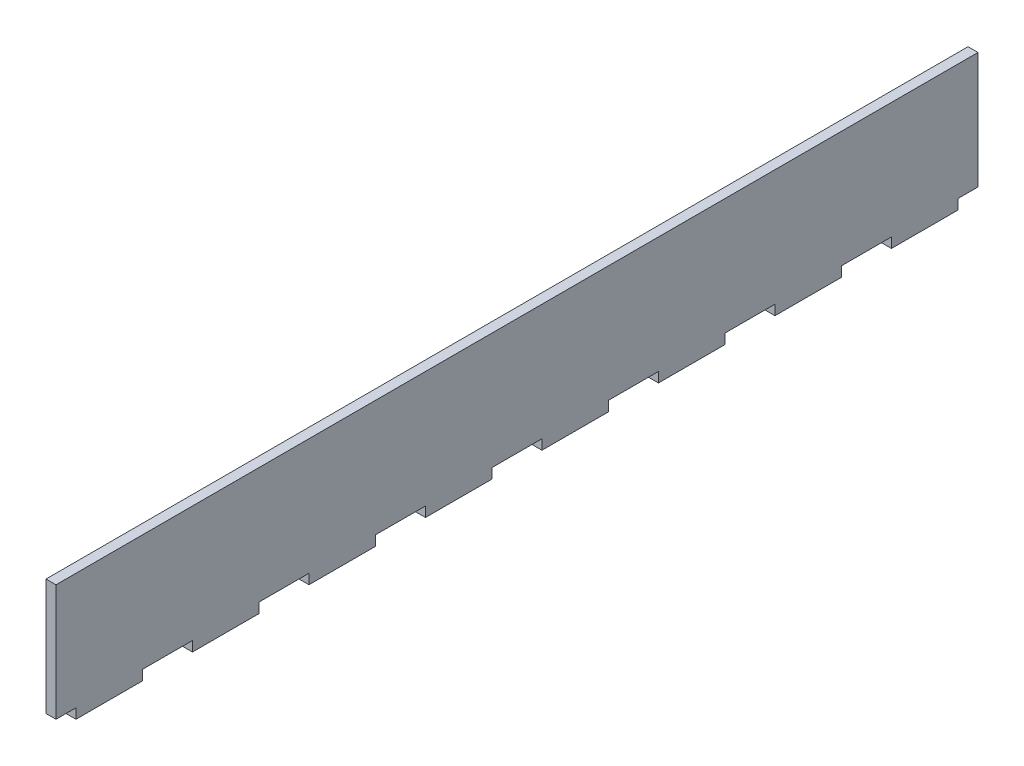
ISO-10303-21;
HEADER;
FILE_DESCRIPTION(('STEP AP214'),'2;1');
FILE_NAME('part.step','',(''),(''),'','','');
FILE_SCHEMA(('AUTOMOTIVE_DESIGN { 1 0 10303 214 1 1 1 1 }'));
ENDSEC;
DATA;
#1=APPLICATION_CONTEXT('core data for automotive mechanical design processes');
#2=APPLICATION_PROTOCOL_DEFINITION('international standard','automotive_design',2000,#1);
#3=PRODUCT_CONTEXT('',#1,'mechanical');
#4=PRODUCT('Part','Part','',(#3));
#5=PRODUCT_RELATED_PRODUCT_CATEGORY('part','',(#4));
#6=PRODUCT_DEFINITION_FORMATION('','',#4);
#7=PRODUCT_DEFINITION_CONTEXT('part definition',#1,'design');
#8=PRODUCT_DEFINITION('design','',#6,#7);
#9=PRODUCT_DEFINITION_SHAPE('','',#8);
#10=(LENGTH_UNIT() NAMED_UNIT(*) SI_UNIT(.MILLI.,.METRE.));
#11=(NAMED_UNIT(*) PLANE_ANGLE_UNIT() SI_UNIT($,.RADIAN.));
#12=(NAMED_UNIT(*) SI_UNIT($,.STERADIAN.) SOLID_ANGLE_UNIT());
#13=UNCERTAINTY_MEASURE_WITH_UNIT(LENGTH_MEASURE(1.E-05),#10,'distance_accuracy_value','');
#14=(GEOMETRIC_REPRESENTATION_CONTEXT(3) GLOBAL_UNCERTAINTY_ASSIGNED_CONTEXT((#13)) GLOBAL_UNIT_ASSIGNED_CONTEXT((#10,
#11,#12)) REPRESENTATION_CONTEXT('',''));
#15=CARTESIAN_POINT('',(0.,0.,0.));
#16=DIRECTION('',(0.,0.,1.));
#17=DIRECTION('',(1.,0.,0.));
#18=AXIS2_PLACEMENT_3D('',#15,#16,#17);
#19=CARTESIAN_POINT('',(3.,0.,0.));
#20=DIRECTION('',(0.,0.,1.));
#21=DIRECTION('',(1.,0.,0.));
#22=AXIS2_PLACEMENT_3D('',#19,#20,#21);
#23=PLANE('',#22);
#24=DIRECTION('',(0.,1.,0.));
#25=VECTOR('',#24,1.);
#26=CARTESIAN_POINT('',(0.,0.,0.));
#27=LINE('',#26,#25);
#28=CARTESIAN_POINT('',(0.,0.,0.));
#29=VERTEX_POINT('',#28);
#30=CARTESIAN_POINT('',(0.,35.,0.));
#31=VERTEX_POINT('',#30);
#32=EDGE_CURVE('E300',#29,#31,#27,.T.);
#33=ORIENTED_EDGE('',*,*,#32,.F.);
#34=DIRECTION('',(-1.,0.,0.));
#35=VECTOR('',#34,1.);
#36=CARTESIAN_POINT('',(3.,0.,0.));
#37=LINE('',#36,#35);
#38=CARTESIAN_POINT('',(3.,0.,0.));
#39=VERTEX_POINT('',#38);
#40=EDGE_CURVE('E11',#39,#29,#37,.T.);
#41=ORIENTED_EDGE('',*,*,#40,.F.);
#42=DIRECTION('',(0.,1.,0.));
#43=VECTOR('',#42,1.);
#44=CARTESIAN_POINT('',(3.,0.,0.));
#45=LINE('',#44,#43);
#46=CARTESIAN_POINT('',(3.,35.,0.));
#47=VERTEX_POINT('',#46);
#48=EDGE_CURVE('E387',#39,#47,#45,.T.);
#49=ORIENTED_EDGE('',*,*,#48,.T.);
#50=DIRECTION('',(-1.,0.,0.));
#51=VECTOR('',#50,1.);
#52=CARTESIAN_POINT('',(3.,35.,0.));
#53=LINE('',#52,#51);
#54=EDGE_CURVE('E36',#47,#31,#53,.T.);
#55=ORIENTED_EDGE('',*,*,#54,.T.);
#56=EDGE_LOOP('',(#33,#41,#49,#55));
#57=FACE_BOUND('',#56,.T.);
#58=ADVANCED_FACE('F33',(#57),#23,.T.);
#59=CARTESIAN_POINT('',(3.,0.,0.));
#60=DIRECTION('',(0.,1.,0.));
#61=DIRECTION('',(0.,0.,1.));
#62=AXIS2_PLACEMENT_3D('',#59,#60,#61);
#63=PLANE('',#62);
#64=DIRECTION('',(0.,0.,-1.));
#65=VECTOR('',#64,1.);
#66=CARTESIAN_POINT('',(0.,0.,0.));
#67=LINE('',#66,#65);
#68=CARTESIAN_POINT('',(0.,0.,-6.00000000000001));
#69=VERTEX_POINT('',#68);
#70=EDGE_CURVE('E162',#29,#69,#67,.T.);
#71=ORIENTED_EDGE('',*,*,#70,.T.);
#72=DIRECTION('',(-1.,0.,0.));
#73=VECTOR('',#72,1.);
#74=CARTESIAN_POINT('',(3.,0.,-6.00000000000001));
#75=LINE('',#74,#73);
#76=CARTESIAN_POINT('',(3.,0.,-6.00000000000001));
#77=VERTEX_POINT('',#76);
#78=EDGE_CURVE('E42',#77,#69,#75,.T.);
#79=ORIENTED_EDGE('',*,*,#78,.F.);
#80=DIRECTION('',(0.,0.,-1.));
#81=VECTOR('',#80,1.);
#82=CARTESIAN_POINT('',(3.,0.,0.));
#83=LINE('',#82,#81);
#84=EDGE_CURVE('E278',#39,#77,#83,.T.);
#85=ORIENTED_EDGE('',*,*,#84,.F.);
#86=ORIENTED_EDGE('',*,*,#40,.T.);
#87=EDGE_LOOP('',(#71,#79,#85,#86));
#88=FACE_BOUND('',#87,.T.);
#89=ADVANCED_FACE('F691',(#88),#63,.F.);
#90=CARTESIAN_POINT('',(3.,0.,-6.00000000000001));
#91=DIRECTION('',(0.,0.,-1.));
#92=DIRECTION('',(0.,1.,0.));
#93=AXIS2_PLACEMENT_3D('',#90,#91,#92);
#94=PLANE('',#93);
#95=DIRECTION('',(0.,-1.,0.));
#96=VECTOR('',#95,1.);
#97=CARTESIAN_POINT('',(0.,0.,-6.00000000000001));
#98=LINE('',#97,#96);
#99=CARTESIAN_POINT('',(0.,-3.,-6.));
#100=VERTEX_POINT('',#99);
#101=EDGE_CURVE('E285',#69,#100,#98,.T.);
#102=ORIENTED_EDGE('',*,*,#101,.T.);
#103=DIRECTION('',(-1.,0.,0.));
#104=VECTOR('',#103,1.);
#105=CARTESIAN_POINT('',(3.,-3.,-6.));
#106=LINE('',#105,#104);
#107=CARTESIAN_POINT('',(3.,-3.,-6.));
#108=VERTEX_POINT('',#107);
#109=EDGE_CURVE('E282',#108,#100,#106,.T.);
#110=ORIENTED_EDGE('',*,*,#109,.F.);
#111=DIRECTION('',(0.,-1.,0.));
#112=VECTOR('',#111,1.);
#113=CARTESIAN_POINT('',(3.,0.,-6.00000000000001));
#114=LINE('',#113,#112);
#115=EDGE_CURVE('E270',#77,#108,#114,.T.);
#116=ORIENTED_EDGE('',*,*,#115,.F.);
#117=ORIENTED_EDGE('',*,*,#78,.T.);
#118=EDGE_LOOP('',(#102,#110,#116,#117));
#119=FACE_BOUND('',#118,.T.);
#120=ADVANCED_FACE('F283',(#119),#94,.F.);
#121=CARTESIAN_POINT('',(3.,-3.,-6.));
#122=DIRECTION('',(0.,1.,0.));
#123=DIRECTION('',(0.,0.,1.));
#124=AXIS2_PLACEMENT_3D('',#121,#122,#123);
#125=PLANE('',#124);
#126=DIRECTION('',(0.,0.,-1.));
#127=VECTOR('',#126,1.);
#128=CARTESIAN_POINT('',(0.,-3.,-6.));
#129=LINE('',#128,#127);
#130=CARTESIAN_POINT('',(0.,-3.,-26.));
#131=VERTEX_POINT('',#130);
#132=EDGE_CURVE('E384',#100,#131,#129,.T.);
#133=ORIENTED_EDGE('',*,*,#132,.T.);
#134=DIRECTION('',(-1.,0.,0.));
#135=VECTOR('',#134,1.);
#136=CARTESIAN_POINT('',(3.,-3.,-26.));
#137=LINE('',#136,#135);
#138=CARTESIAN_POINT('',(3.,-3.,-26.));
#139=VERTEX_POINT('',#138);
#140=EDGE_CURVE('E289',#139,#131,#137,.T.);
#141=ORIENTED_EDGE('',*,*,#140,.F.);
#142=DIRECTION('',(0.,0.,-1.));
#143=VECTOR('',#142,1.);
#144=CARTESIAN_POINT('',(3.,-3.,-6.));
#145=LINE('',#144,#143);
#146=EDGE_CURVE('E276',#108,#139,#145,.T.);
#147=ORIENTED_EDGE('',*,*,#146,.F.);
#148=ORIENTED_EDGE('',*,*,#109,.T.);
#149=EDGE_LOOP('',(#133,#141,#147,#148));
#150=FACE_BOUND('',#149,.T.);
#151=ADVANCED_FACE('F291',(#150),#125,.F.);
#152=CARTESIAN_POINT('',(3.,0.,-26.));
#153=DIRECTION('',(0.,0.,-1.));
#154=DIRECTION('',(0.,1.,0.));
#155=AXIS2_PLACEMENT_3D('',#152,#153,#154);
#156=PLANE('',#155);
#157=DIRECTION('',(0.,-1.,0.));
#158=VECTOR('',#157,1.);
#159=CARTESIAN_POINT('',(0.,0.,-26.));
#160=LINE('',#159,#158);
#161=CARTESIAN_POINT('',(0.,0.,-26.));
#162=VERTEX_POINT('',#161);
#163=EDGE_CURVE('E381',#162,#131,#160,.T.);
#164=ORIENTED_EDGE('',*,*,#163,.F.);
#165=DIRECTION('',(-1.,0.,0.));
#166=VECTOR('',#165,1.);
#167=CARTESIAN_POINT('',(3.,0.,-26.));
#168=LINE('',#167,#166);
#169=CARTESIAN_POINT('',(3.,0.,-26.));
#170=VERTEX_POINT('',#169);
#171=EDGE_CURVE('E391',#170,#162,#168,.T.);
#172=ORIENTED_EDGE('',*,*,#171,.F.);
#173=DIRECTION('',(0.,-1.,0.));
#174=VECTOR('',#173,1.);
#175=CARTESIAN_POINT('',(3.,0.,-26.));
#176=LINE('',#175,#174);
#177=EDGE_CURVE('E293',#170,#139,#176,.T.);
#178=ORIENTED_EDGE('',*,*,#177,.T.);
#179=ORIENTED_EDGE('',*,*,#140,.T.);
#180=EDGE_LOOP('',(#164,#172,#178,#179));
#181=FACE_BOUND('',#180,.T.);
#182=ADVANCED_FACE('F475',(#181),#156,.T.);
#183=CARTESIAN_POINT('',(3.,0.,-26.));
#184=DIRECTION('',(0.,1.,0.));
#185=DIRECTION('',(0.,0.,1.));
#186=AXIS2_PLACEMENT_3D('',#183,#184,#185);
#187=PLANE('',#186);
#188=DIRECTION('',(0.,0.,-1.));
#189=VECTOR('',#188,1.);
#190=CARTESIAN_POINT('',(0.,0.,-26.));
#191=LINE('',#190,#189);
#192=CARTESIAN_POINT('',(0.,0.,-41.));
#193=VERTEX_POINT('',#192);
#194=EDGE_CURVE('E379',#162,#193,#191,.T.);
#195=ORIENTED_EDGE('',*,*,#194,.T.);
#196=DIRECTION('',(-1.,0.,0.));
#197=VECTOR('',#196,1.);
#198=CARTESIAN_POINT('',(3.,0.,-41.));
#199=LINE('',#198,#197);
#200=CARTESIAN_POINT('',(3.,0.,-41.));
#201=VERTEX_POINT('',#200);
#202=EDGE_CURVE('E393',#201,#193,#199,.T.);
#203=ORIENTED_EDGE('',*,*,#202,.F.);
#204=DIRECTION('',(0.,0.,-1.));
#205=VECTOR('',#204,1.);
#206=CARTESIAN_POINT('',(3.,0.,-26.));
#207=LINE('',#206,#205);
#208=EDGE_CURVE('E295',#170,#201,#207,.T.);
#209=ORIENTED_EDGE('',*,*,#208,.F.);
#210=ORIENTED_EDGE('',*,*,#171,.T.);
#211=EDGE_LOOP('',(#195,#203,#209,#210));
#212=FACE_BOUND('',#211,.T.);
#213=ADVANCED_FACE('F482',(#212),#187,.F.);
#214=CARTESIAN_POINT('',(3.,0.,-41.));
#215=DIRECTION('',(0.,0.,-1.));
#216=DIRECTION('',(0.,1.,0.));
#217=AXIS2_PLACEMENT_3D('',#214,#215,#216);
#218=PLANE('',#217);
#219=DIRECTION('',(0.,-1.,0.));
#220=VECTOR('',#219,1.);
#221=CARTESIAN_POINT('',(0.,0.,-41.));
#222=LINE('',#221,#220);
#223=CARTESIAN_POINT('',(0.,-3.,-41.));
#224=VERTEX_POINT('',#223);
#225=EDGE_CURVE('E377',#193,#224,#222,.T.);
#226=ORIENTED_EDGE('',*,*,#225,.T.);
#227=DIRECTION('',(-1.,0.,0.));
#228=VECTOR('',#227,1.);
#229=CARTESIAN_POINT('',(3.,-3.,-41.));
#230=LINE('',#229,#228);
#231=CARTESIAN_POINT('',(3.,-3.,-41.));
#232=VERTEX_POINT('',#231);
#233=EDGE_CURVE('E396',#232,#224,#230,.T.);
#234=ORIENTED_EDGE('',*,*,#233,.F.);
#235=DIRECTION('',(0.,-1.,0.));
#236=VECTOR('',#235,1.);
#237=CARTESIAN_POINT('',(3.,0.,-41.));
#238=LINE('',#237,#236);
#239=EDGE_CURVE('E479',#201,#232,#238,.T.);
#240=ORIENTED_EDGE('',*,*,#239,.F.);
#241=ORIENTED_EDGE('',*,*,#202,.T.);
#242=EDGE_LOOP('',(#226,#234,#240,#241));
#243=FACE_BOUND('',#242,.T.);
#244=ADVANCED_FACE('F484',(#243),#218,.F.);
#245=CARTESIAN_POINT('',(3.,-3.,-41.));
#246=DIRECTION('',(0.,1.,0.));
#247=DIRECTION('',(0.,0.,1.));
#248=AXIS2_PLACEMENT_3D('',#245,#246,#247);
#249=PLANE('',#248);
#250=DIRECTION('',(0.,0.,-1.));
#251=VECTOR('',#250,1.);
#252=CARTESIAN_POINT('',(0.,-3.,-41.));
#253=LINE('',#252,#251);
#254=CARTESIAN_POINT('',(0.,-3.,-61.));
#255=VERTEX_POINT('',#254);
#256=EDGE_CURVE('E374',#224,#255,#253,.T.);
#257=ORIENTED_EDGE('',*,*,#256,.T.);
#258=DIRECTION('',(-1.,0.,0.));
#259=VECTOR('',#258,1.);
#260=CARTESIAN_POINT('',(3.,-3.,-61.));
#261=LINE('',#260,#259);
#262=CARTESIAN_POINT('',(3.,-3.,-61.));
#263=VERTEX_POINT('',#262);
#264=EDGE_CURVE('E399',#263,#255,#261,.T.);
#265=ORIENTED_EDGE('',*,*,#264,.F.);
#266=DIRECTION('',(0.,0.,-1.));
#267=VECTOR('',#266,1.);
#268=CARTESIAN_POINT('',(3.,-3.,-41.));
#269=LINE('',#268,#267);
#270=EDGE_CURVE('E486',#232,#263,#269,.T.);
#271=ORIENTED_EDGE('',*,*,#270,.F.);
#272=ORIENTED_EDGE('',*,*,#233,.T.);
#273=EDGE_LOOP('',(#257,#265,#271,#272));
#274=FACE_BOUND('',#273,.T.);
#275=ADVANCED_FACE('F681',(#274),#249,.F.);
#276=CARTESIAN_POINT('',(3.,0.,-61.));
#277=DIRECTION('',(0.,0.,-1.));
#278=DIRECTION('',(0.,1.,0.));
#279=AXIS2_PLACEMENT_3D('',#276,#277,#278);
#280=PLANE('',#279);
#281=DIRECTION('',(0.,-1.,0.));
#282=VECTOR('',#281,1.);
#283=CARTESIAN_POINT('',(0.,0.,-61.));
#284=LINE('',#283,#282);
#285=CARTESIAN_POINT('',(0.,0.,-61.));
#286=VERTEX_POINT('',#285);
#287=EDGE_CURVE('E371',#286,#255,#284,.T.);
#288=ORIENTED_EDGE('',*,*,#287,.F.);
#289=DIRECTION('',(-1.,0.,0.));
#290=VECTOR('',#289,1.);
#291=CARTESIAN_POINT('',(3.,0.,-61.));
#292=LINE('',#291,#290);
#293=CARTESIAN_POINT('',(3.,0.,-61.));
#294=VERTEX_POINT('',#293);
#295=EDGE_CURVE('E401',#294,#286,#292,.T.);
#296=ORIENTED_EDGE('',*,*,#295,.F.);
#297=DIRECTION('',(0.,-1.,0.));
#298=VECTOR('',#297,1.);
#299=CARTESIAN_POINT('',(3.,0.,-61.));
#300=LINE('',#299,#298);
#301=EDGE_CURVE('E488',#294,#263,#300,.T.);
#302=ORIENTED_EDGE('',*,*,#301,.T.);
#303=ORIENTED_EDGE('',*,*,#264,.T.);
#304=EDGE_LOOP('',(#288,#296,#302,#303));
#305=FACE_BOUND('',#304,.T.);
#306=ADVANCED_FACE('F678',(#305),#280,.T.);
#307=CARTESIAN_POINT('',(3.,0.,-61.));
#308=DIRECTION('',(0.,1.,0.));
#309=DIRECTION('',(0.,0.,1.));
#310=AXIS2_PLACEMENT_3D('',#307,#308,#309);
#311=PLANE('',#310);
#312=DIRECTION('',(0.,0.,-1.));
#313=VECTOR('',#312,1.);
#314=CARTESIAN_POINT('',(0.,0.,-61.));
#315=LINE('',#314,#313);
#316=CARTESIAN_POINT('',(0.,0.,-76.));
#317=VERTEX_POINT('',#316);
#318=EDGE_CURVE('E369',#286,#317,#315,.T.);
#319=ORIENTED_EDGE('',*,*,#318,.T.);
#320=DIRECTION('',(-1.,0.,0.));
#321=VECTOR('',#320,1.);
#322=CARTESIAN_POINT('',(3.,0.,-76.));
#323=LINE('',#322,#321);
#324=CARTESIAN_POINT('',(3.,0.,-76.));
#325=VERTEX_POINT('',#324);
#326=EDGE_CURVE('E403',#325,#317,#323,.T.);
#327=ORIENTED_EDGE('',*,*,#326,.F.);
#328=DIRECTION('',(0.,0.,-1.));
#329=VECTOR('',#328,1.);
#330=CARTESIAN_POINT('',(3.,0.,-61.));
#331=LINE('',#330,#329);
#332=EDGE_CURVE('E493',#294,#325,#331,.T.);
#333=ORIENTED_EDGE('',*,*,#332,.F.);
#334=ORIENTED_EDGE('',*,*,#295,.T.);
#335=EDGE_LOOP('',(#319,#327,#333,#334));
#336=FACE_BOUND('',#335,.T.);
#337=ADVANCED_FACE('F673',(#336),#311,.F.);
#338=CARTESIAN_POINT('',(3.,0.,-76.));
#339=DIRECTION('',(0.,0.,-1.));
#340=DIRECTION('',(-1.,0.,0.));
#341=AXIS2_PLACEMENT_3D('',#338,#339,#340);
#342=PLANE('',#341);
#343=DIRECTION('',(0.,-1.,0.));
#344=VECTOR('',#343,1.);
#345=CARTESIAN_POINT('',(0.,0.,-76.));
#346=LINE('',#345,#344);
#347=CARTESIAN_POINT('',(0.,-3.,-76.));
#348=VERTEX_POINT('',#347);
#349=EDGE_CURVE('E367',#317,#348,#346,.T.);
#350=ORIENTED_EDGE('',*,*,#349,.T.);
#351=DIRECTION('',(-1.,0.,0.));
#352=VECTOR('',#351,1.);
#353=CARTESIAN_POINT('',(3.,-3.,-76.));
#354=LINE('',#353,#352);
#355=CARTESIAN_POINT('',(3.,-3.,-76.));
#356=VERTEX_POINT('',#355);
#357=EDGE_CURVE('E406',#356,#348,#354,.T.);
#358=ORIENTED_EDGE('',*,*,#357,.F.);
#359=DIRECTION('',(0.,-1.,0.));
#360=VECTOR('',#359,1.);
#361=CARTESIAN_POINT('',(3.,0.,-76.));
#362=LINE('',#361,#360);
#363=EDGE_CURVE('E495',#325,#356,#362,.T.);
#364=ORIENTED_EDGE('',*,*,#363,.F.);
#365=ORIENTED_EDGE('',*,*,#326,.T.);
#366=EDGE_LOOP('',(#350,#358,#364,#365));
#367=FACE_BOUND('',#366,.T.);
#368=ADVANCED_FACE('F669',(#367),#342,.F.);
#369=CARTESIAN_POINT('',(3.,-3.,-76.));
#370=DIRECTION('',(0.,1.,0.));
#371=DIRECTION('',(0.,0.,1.));
#372=AXIS2_PLACEMENT_3D('',#369,#370,#371);
#373=PLANE('',#372);
#374=DIRECTION('',(0.,0.,-1.));
#375=VECTOR('',#374,1.);
#376=CARTESIAN_POINT('',(0.,-3.,-76.));
#377=LINE('',#376,#375);
#378=CARTESIAN_POINT('',(0.,-3.,-96.));
#379=VERTEX_POINT('',#378);
#380=EDGE_CURVE('E364',#348,#379,#377,.T.);
#381=ORIENTED_EDGE('',*,*,#380,.T.);
#382=DIRECTION('',(-1.,0.,0.));
#383=VECTOR('',#382,1.);
#384=CARTESIAN_POINT('',(3.,-3.,-96.));
#385=LINE('',#384,#383);
#386=CARTESIAN_POINT('',(3.,-3.,-96.));
#387=VERTEX_POINT('',#386);
#388=EDGE_CURVE('E409',#387,#379,#385,.T.);
#389=ORIENTED_EDGE('',*,*,#388,.F.);
#390=DIRECTION('',(0.,0.,-1.));
#391=VECTOR('',#390,1.);
#392=CARTESIAN_POINT('',(3.,-3.,-76.));
#393=LINE('',#392,#391);
#394=EDGE_CURVE('E497',#356,#387,#393,.T.);
#395=ORIENTED_EDGE('',*,*,#394,.F.);
#396=ORIENTED_EDGE('',*,*,#357,.T.);
#397=EDGE_LOOP('',(#381,#389,#395,#396));
#398=FACE_BOUND('',#397,.T.);
#399=ADVANCED_FACE('F664',(#398),#373,.F.);
#400=CARTESIAN_POINT('',(3.,0.,-96.));
#401=DIRECTION('',(0.,0.,-1.));
#402=DIRECTION('',(0.,1.,0.));
#403=AXIS2_PLACEMENT_3D('',#400,#401,#402);
#404=PLANE('',#403);
#405=DIRECTION('',(0.,-1.,0.));
#406=VECTOR('',#405,1.);
#407=CARTESIAN_POINT('',(0.,0.,-96.));
#408=LINE('',#407,#406);
#409=CARTESIAN_POINT('',(0.,0.,-96.));
#410=VERTEX_POINT('',#409);
#411=EDGE_CURVE('E361',#410,#379,#408,.T.);
#412=ORIENTED_EDGE('',*,*,#411,.F.);
#413=DIRECTION('',(-1.,0.,0.));
#414=VECTOR('',#413,1.);
#415=CARTESIAN_POINT('',(3.,0.,-96.));
#416=LINE('',#415,#414);
#417=CARTESIAN_POINT('',(3.,0.,-96.));
#418=VERTEX_POINT('',#417);
#419=EDGE_CURVE('E411',#418,#410,#416,.T.);
#420=ORIENTED_EDGE('',*,*,#419,.F.);
#421=DIRECTION('',(0.,-1.,0.));
#422=VECTOR('',#421,1.);
#423=CARTESIAN_POINT('',(3.,0.,-96.));
#424=LINE('',#423,#422);
#425=EDGE_CURVE('E499',#418,#387,#424,.T.);
#426=ORIENTED_EDGE('',*,*,#425,.T.);
#427=ORIENTED_EDGE('',*,*,#388,.T.);
#428=EDGE_LOOP('',(#412,#420,#426,#427));
#429=FACE_BOUND('',#428,.T.);
#430=ADVANCED_FACE('F658',(#429),#404,.T.);
#431=CARTESIAN_POINT('',(3.,0.,-96.));
#432=DIRECTION('',(0.,1.,0.));
#433=DIRECTION('',(0.,0.,1.));
#434=AXIS2_PLACEMENT_3D('',#431,#432,#433);
#435=PLANE('',#434);
#436=DIRECTION('',(0.,0.,-1.));
#437=VECTOR('',#436,1.);
#438=CARTESIAN_POINT('',(0.,0.,-96.));
#439=LINE('',#438,#437);
#440=CARTESIAN_POINT('',(0.,0.,-111.));
#441=VERTEX_POINT('',#440);
#442=EDGE_CURVE('E359',#410,#441,#439,.T.);
#443=ORIENTED_EDGE('',*,*,#442,.T.);
#444=DIRECTION('',(-1.,0.,0.));
#445=VECTOR('',#444,1.);
#446=CARTESIAN_POINT('',(3.,0.,-111.));
#447=LINE('',#446,#445);
#448=CARTESIAN_POINT('',(3.,0.,-111.));
#449=VERTEX_POINT('',#448);
#450=EDGE_CURVE('E413',#449,#441,#447,.T.);
#451=ORIENTED_EDGE('',*,*,#450,.F.);
#452=DIRECTION('',(0.,0.,-1.));
#453=VECTOR('',#452,1.);
#454=CARTESIAN_POINT('',(3.,0.,-96.));
#455=LINE('',#454,#453);
#456=EDGE_CURVE('E502',#418,#449,#455,.T.);
#457=ORIENTED_EDGE('',*,*,#456,.F.);
#458=ORIENTED_EDGE('',*,*,#419,.T.);
#459=EDGE_LOOP('',(#443,#451,#457,#458));
#460=FACE_BOUND('',#459,.T.);
#461=ADVANCED_FACE('F655',(#460),#435,.F.);
#462=CARTESIAN_POINT('',(3.,0.,-111.));
#463=DIRECTION('',(0.,0.,-1.));
#464=DIRECTION('',(-1.,0.,0.));
#465=AXIS2_PLACEMENT_3D('',#462,#463,#464);
#466=PLANE('',#465);
#467=DIRECTION('',(0.,-1.,0.));
#468=VECTOR('',#467,1.);
#469=CARTESIAN_POINT('',(0.,0.,-111.));
#470=LINE('',#469,#468);
#471=CARTESIAN_POINT('',(0.,-3.,-111.));
#472=VERTEX_POINT('',#471);
#473=EDGE_CURVE('E357',#441,#472,#470,.T.);
#474=ORIENTED_EDGE('',*,*,#473,.T.);
#475=DIRECTION('',(-1.,0.,0.));
#476=VECTOR('',#475,1.);
#477=CARTESIAN_POINT('',(3.,-3.,-111.));
#478=LINE('',#477,#476);
#479=CARTESIAN_POINT('',(3.,-3.,-111.));
#480=VERTEX_POINT('',#479);
#481=EDGE_CURVE('E416',#480,#472,#478,.T.);
#482=ORIENTED_EDGE('',*,*,#481,.F.);
#483=DIRECTION('',(0.,-1.,0.));
#484=VECTOR('',#483,1.);
#485=CARTESIAN_POINT('',(3.,0.,-111.));
#486=LINE('',#485,#484);
#487=EDGE_CURVE('E504',#449,#480,#486,.T.);
#488=ORIENTED_EDGE('',*,*,#487,.F.);
#489=ORIENTED_EDGE('',*,*,#450,.T.);
#490=EDGE_LOOP('',(#474,#482,#488,#489));
#491=FACE_BOUND('',#490,.T.);
#492=ADVANCED_FACE('F650',(#491),#466,.F.);
#493=CARTESIAN_POINT('',(3.,-3.,-111.));
#494=DIRECTION('',(0.,1.,0.));
#495=DIRECTION('',(0.,0.,1.));
#496=AXIS2_PLACEMENT_3D('',#493,#494,#495);
#497=PLANE('',#496);
#498=DIRECTION('',(0.,0.,-1.));
#499=VECTOR('',#498,1.);
#500=CARTESIAN_POINT('',(0.,-3.,-111.));
#501=LINE('',#500,#499);
#502=CARTESIAN_POINT('',(0.,-3.,-131.));
#503=VERTEX_POINT('',#502);
#504=EDGE_CURVE('E354',#472,#503,#501,.T.);
#505=ORIENTED_EDGE('',*,*,#504,.T.);
#506=DIRECTION('',(-1.,0.,0.));
#507=VECTOR('',#506,1.);
#508=CARTESIAN_POINT('',(3.,-3.,-131.));
#509=LINE('',#508,#507);
#510=CARTESIAN_POINT('',(3.,-3.,-131.));
#511=VERTEX_POINT('',#510);
#512=EDGE_CURVE('E419',#511,#503,#509,.T.);
#513=ORIENTED_EDGE('',*,*,#512,.F.);
#514=DIRECTION('',(0.,0.,-1.));
#515=VECTOR('',#514,1.);
#516=CARTESIAN_POINT('',(3.,-3.,-111.));
#517=LINE('',#516,#515);
#518=EDGE_CURVE('E506',#480,#511,#517,.T.);
#519=ORIENTED_EDGE('',*,*,#518,.F.);
#520=ORIENTED_EDGE('',*,*,#481,.T.);
#521=EDGE_LOOP('',(#505,#513,#519,#520));
#522=FACE_BOUND('',#521,.T.);
#523=ADVANCED_FACE('F644',(#522),#497,.F.);
#524=CARTESIAN_POINT('',(3.,0.,-131.));
#525=DIRECTION('',(0.,0.,-1.));
#526=DIRECTION('',(0.,1.,0.));
#527=AXIS2_PLACEMENT_3D('',#524,#525,#526);
#528=PLANE('',#527);
#529=DIRECTION('',(0.,-1.,0.));
#530=VECTOR('',#529,1.);
#531=CARTESIAN_POINT('',(0.,0.,-131.));
#532=LINE('',#531,#530);
#533=CARTESIAN_POINT('',(0.,0.,-131.));
#534=VERTEX_POINT('',#533);
#535=EDGE_CURVE('E351',#534,#503,#532,.T.);
#536=ORIENTED_EDGE('',*,*,#535,.F.);
#537=DIRECTION('',(-1.,0.,0.));
#538=VECTOR('',#537,1.);
#539=CARTESIAN_POINT('',(3.,0.,-131.));
#540=LINE('',#539,#538);
#541=CARTESIAN_POINT('',(3.,0.,-131.));
#542=VERTEX_POINT('',#541);
#543=EDGE_CURVE('E421',#542,#534,#540,.T.);
#544=ORIENTED_EDGE('',*,*,#543,.F.);
#545=DIRECTION('',(0.,-1.,0.));
#546=VECTOR('',#545,1.);
#547=CARTESIAN_POINT('',(3.,0.,-131.));
#548=LINE('',#547,#546);
#549=EDGE_CURVE('E508',#542,#511,#548,.T.);
#550=ORIENTED_EDGE('',*,*,#549,.T.);
#551=ORIENTED_EDGE('',*,*,#512,.T.);
#552=EDGE_LOOP('',(#536,#544,#550,#551));
#553=FACE_BOUND('',#552,.T.);
#554=ADVANCED_FACE('F640',(#553),#528,.T.);
#555=CARTESIAN_POINT('',(3.,0.,-131.));
#556=DIRECTION('',(0.,1.,0.));
#557=DIRECTION('',(0.,0.,1.));
#558=AXIS2_PLACEMENT_3D('',#555,#556,#557);
#559=PLANE('',#558);
#560=DIRECTION('',(0.,0.,-1.));
#561=VECTOR('',#560,1.);
#562=CARTESIAN_POINT('',(0.,0.,-131.));
#563=LINE('',#562,#561);
#564=CARTESIAN_POINT('',(0.,0.,-146.));
#565=VERTEX_POINT('',#564);
#566=EDGE_CURVE('E349',#534,#565,#563,.T.);
#567=ORIENTED_EDGE('',*,*,#566,.T.);
#568=DIRECTION('',(-1.,0.,0.));
#569=VECTOR('',#568,1.);
#570=CARTESIAN_POINT('',(3.,0.,-146.));
#571=LINE('',#570,#569);
#572=CARTESIAN_POINT('',(3.,0.,-146.));
#573=VERTEX_POINT('',#572);
#574=EDGE_CURVE('E423',#573,#565,#571,.T.);
#575=ORIENTED_EDGE('',*,*,#574,.F.);
#576=DIRECTION('',(0.,0.,-1.));
#577=VECTOR('',#576,1.);
#578=CARTESIAN_POINT('',(3.,0.,-131.));
#579=LINE('',#578,#577);
#580=EDGE_CURVE('E511',#542,#573,#579,.T.);
#581=ORIENTED_EDGE('',*,*,#580,.F.);
#582=ORIENTED_EDGE('',*,*,#543,.T.);
#583=EDGE_LOOP('',(#567,#575,#581,#582));
#584=FACE_BOUND('',#583,.T.);
#585=ADVANCED_FACE('F635',(#584),#559,.F.);
#586=CARTESIAN_POINT('',(3.,0.,-146.));
#587=DIRECTION('',(0.,0.,-1.));
#588=DIRECTION('',(-1.,0.,0.));
#589=AXIS2_PLACEMENT_3D('',#586,#587,#588);
#590=PLANE('',#589);
#591=DIRECTION('',(0.,-1.,0.));
#592=VECTOR('',#591,1.);
#593=CARTESIAN_POINT('',(0.,0.,-146.));
#594=LINE('',#593,#592);
#595=CARTESIAN_POINT('',(0.,-3.,-146.));
#596=VERTEX_POINT('',#595);
#597=EDGE_CURVE('E347',#565,#596,#594,.T.);
#598=ORIENTED_EDGE('',*,*,#597,.T.);
#599=DIRECTION('',(-1.,0.,0.));
#600=VECTOR('',#599,1.);
#601=CARTESIAN_POINT('',(3.,-3.,-146.));
#602=LINE('',#601,#600);
#603=CARTESIAN_POINT('',(3.,-3.,-146.));
#604=VERTEX_POINT('',#603);
#605=EDGE_CURVE('E426',#604,#596,#602,.T.);
#606=ORIENTED_EDGE('',*,*,#605,.F.);
#607=DIRECTION('',(0.,-1.,0.));
#608=VECTOR('',#607,1.);
#609=CARTESIAN_POINT('',(3.,0.,-146.));
#610=LINE('',#609,#608);
#611=EDGE_CURVE('E513',#573,#604,#610,.T.);
#612=ORIENTED_EDGE('',*,*,#611,.F.);
#613=ORIENTED_EDGE('',*,*,#574,.T.);
#614=EDGE_LOOP('',(#598,#606,#612,#613));
#615=FACE_BOUND('',#614,.T.);
#616=ADVANCED_FACE('F631',(#615),#590,.F.);
#617=CARTESIAN_POINT('',(3.,-3.,-146.));
#618=DIRECTION('',(0.,1.,0.));
#619=DIRECTION('',(0.,0.,1.));
#620=AXIS2_PLACEMENT_3D('',#617,#618,#619);
#621=PLANE('',#620);
#622=DIRECTION('',(0.,0.,-1.));
#623=VECTOR('',#622,1.);
#624=CARTESIAN_POINT('',(0.,-3.,-146.));
#625=LINE('',#624,#623);
#626=CARTESIAN_POINT('',(0.,-3.,-166.));
#627=VERTEX_POINT('',#626);
#628=EDGE_CURVE('E344',#596,#627,#625,.T.);
#629=ORIENTED_EDGE('',*,*,#628,.T.);
#630=DIRECTION('',(-1.,0.,0.));
#631=VECTOR('',#630,1.);
#632=CARTESIAN_POINT('',(3.,-3.,-166.));
#633=LINE('',#632,#631);
#634=CARTESIAN_POINT('',(3.,-3.,-166.));
#635=VERTEX_POINT('',#634);
#636=EDGE_CURVE('E429',#635,#627,#633,.T.);
#637=ORIENTED_EDGE('',*,*,#636,.F.);
#638=DIRECTION('',(0.,0.,-1.));
#639=VECTOR('',#638,1.);
#640=CARTESIAN_POINT('',(3.,-3.,-146.));
#641=LINE('',#640,#639);
#642=EDGE_CURVE('E515',#604,#635,#641,.T.);
#643=ORIENTED_EDGE('',*,*,#642,.F.);
#644=ORIENTED_EDGE('',*,*,#605,.T.);
#645=EDGE_LOOP('',(#629,#637,#643,#644));
#646=FACE_BOUND('',#645,.T.);
#647=ADVANCED_FACE('F626',(#646),#621,.F.);
#648=CARTESIAN_POINT('',(3.,0.,-166.));
#649=DIRECTION('',(0.,0.,-1.));
#650=DIRECTION('',(0.,1.,0.));
#651=AXIS2_PLACEMENT_3D('',#648,#649,#650);
#652=PLANE('',#651);
#653=DIRECTION('',(0.,-1.,0.));
#654=VECTOR('',#653,1.);
#655=CARTESIAN_POINT('',(0.,0.,-166.));
#656=LINE('',#655,#654);
#657=CARTESIAN_POINT('',(0.,0.,-166.));
#658=VERTEX_POINT('',#657);
#659=EDGE_CURVE('E341',#658,#627,#656,.T.);
#660=ORIENTED_EDGE('',*,*,#659,.F.);
#661=DIRECTION('',(-1.,0.,0.));
#662=VECTOR('',#661,1.);
#663=CARTESIAN_POINT('',(3.,0.,-166.));
#664=LINE('',#663,#662);
#665=CARTESIAN_POINT('',(3.,0.,-166.));
#666=VERTEX_POINT('',#665);
#667=EDGE_CURVE('E431',#666,#658,#664,.T.);
#668=ORIENTED_EDGE('',*,*,#667,.F.);
#669=DIRECTION('',(0.,-1.,0.));
#670=VECTOR('',#669,1.);
#671=CARTESIAN_POINT('',(3.,0.,-166.));
#672=LINE('',#671,#670);
#673=EDGE_CURVE('E517',#666,#635,#672,.T.);
#674=ORIENTED_EDGE('',*,*,#673,.T.);
#675=ORIENTED_EDGE('',*,*,#636,.T.);
#676=EDGE_LOOP('',(#660,#668,#674,#675));
#677=FACE_BOUND('',#676,.T.);
#678=ADVANCED_FACE('F620',(#677),#652,.T.);
#679=CARTESIAN_POINT('',(3.,0.,-166.));
#680=DIRECTION('',(0.,1.,0.));
#681=DIRECTION('',(0.,0.,1.));
#682=AXIS2_PLACEMENT_3D('',#679,#680,#681);
#683=PLANE('',#682);
#684=DIRECTION('',(0.,0.,-1.));
#685=VECTOR('',#684,1.);
#686=CARTESIAN_POINT('',(0.,0.,-166.));
#687=LINE('',#686,#685);
#688=CARTESIAN_POINT('',(0.,0.,-181.));
#689=VERTEX_POINT('',#688);
#690=EDGE_CURVE('E339',#658,#689,#687,.T.);
#691=ORIENTED_EDGE('',*,*,#690,.T.);
#692=DIRECTION('',(-1.,0.,0.));
#693=VECTOR('',#692,1.);
#694=CARTESIAN_POINT('',(3.,0.,-181.));
#695=LINE('',#694,#693);
#696=CARTESIAN_POINT('',(3.,0.,-181.));
#697=VERTEX_POINT('',#696);
#698=EDGE_CURVE('E433',#697,#689,#695,.T.);
#699=ORIENTED_EDGE('',*,*,#698,.F.);
#700=DIRECTION('',(0.,0.,-1.));
#701=VECTOR('',#700,1.);
#702=CARTESIAN_POINT('',(3.,0.,-166.));
#703=LINE('',#702,#701);
#704=EDGE_CURVE('E520',#666,#697,#703,.T.);
#705=ORIENTED_EDGE('',*,*,#704,.F.);
#706=ORIENTED_EDGE('',*,*,#667,.T.);
#707=EDGE_LOOP('',(#691,#699,#705,#706));
#708=FACE_BOUND('',#707,.T.);
#709=ADVANCED_FACE('F617',(#708),#683,.F.);
#710=CARTESIAN_POINT('',(3.,0.,-181.));
#711=DIRECTION('',(0.,0.,-1.));
#712=DIRECTION('',(-1.,0.,0.));
#713=AXIS2_PLACEMENT_3D('',#710,#711,#712);
#714=PLANE('',#713);
#715=DIRECTION('',(0.,-1.,0.));
#716=VECTOR('',#715,1.);
#717=CARTESIAN_POINT('',(0.,0.,-181.));
#718=LINE('',#717,#716);
#719=CARTESIAN_POINT('',(0.,-3.,-181.));
#720=VERTEX_POINT('',#719);
#721=EDGE_CURVE('E337',#689,#720,#718,.T.);
#722=ORIENTED_EDGE('',*,*,#721,.T.);
#723=DIRECTION('',(-1.,0.,0.));
#724=VECTOR('',#723,1.);
#725=CARTESIAN_POINT('',(3.,-3.,-181.));
#726=LINE('',#725,#724);
#727=CARTESIAN_POINT('',(3.,-3.,-181.));
#728=VERTEX_POINT('',#727);
#729=EDGE_CURVE('E436',#728,#720,#726,.T.);
#730=ORIENTED_EDGE('',*,*,#729,.F.);
#731=DIRECTION('',(0.,-1.,0.));
#732=VECTOR('',#731,1.);
#733=CARTESIAN_POINT('',(3.,0.,-181.));
#734=LINE('',#733,#732);
#735=EDGE_CURVE('E522',#697,#728,#734,.T.);
#736=ORIENTED_EDGE('',*,*,#735,.F.);
#737=ORIENTED_EDGE('',*,*,#698,.T.);
#738=EDGE_LOOP('',(#722,#730,#736,#737));
#739=FACE_BOUND('',#738,.T.);
#740=ADVANCED_FACE('F612',(#739),#714,.F.);
#741=CARTESIAN_POINT('',(3.,-3.,-181.));
#742=DIRECTION('',(0.,1.,0.));
#743=DIRECTION('',(0.,0.,1.));
#744=AXIS2_PLACEMENT_3D('',#741,#742,#743);
#745=PLANE('',#744);
#746=DIRECTION('',(0.,0.,-1.));
#747=VECTOR('',#746,1.);
#748=CARTESIAN_POINT('',(0.,-3.,-181.));
#749=LINE('',#748,#747);
#750=CARTESIAN_POINT('',(0.,-3.,-201.));
#751=VERTEX_POINT('',#750);
#752=EDGE_CURVE('E334',#720,#751,#749,.T.);
#753=ORIENTED_EDGE('',*,*,#752,.T.);
#754=DIRECTION('',(-1.,0.,0.));
#755=VECTOR('',#754,1.);
#756=CARTESIAN_POINT('',(3.,-3.,-201.));
#757=LINE('',#756,#755);
#758=CARTESIAN_POINT('',(3.,-3.,-201.));
#759=VERTEX_POINT('',#758);
#760=EDGE_CURVE('E439',#759,#751,#757,.T.);
#761=ORIENTED_EDGE('',*,*,#760,.F.);
#762=DIRECTION('',(0.,0.,-1.));
#763=VECTOR('',#762,1.);
#764=CARTESIAN_POINT('',(3.,-3.,-181.));
#765=LINE('',#764,#763);
#766=EDGE_CURVE('E524',#728,#759,#765,.T.);
#767=ORIENTED_EDGE('',*,*,#766,.F.);
#768=ORIENTED_EDGE('',*,*,#729,.T.);
#769=EDGE_LOOP('',(#753,#761,#767,#768));
#770=FACE_BOUND('',#769,.T.);
#771=ADVANCED_FACE('F606',(#770),#745,.F.);
#772=CARTESIAN_POINT('',(3.,0.,-201.));
#773=DIRECTION('',(0.,0.,-1.));
#774=DIRECTION('',(0.,1.,0.));
#775=AXIS2_PLACEMENT_3D('',#772,#773,#774);
#776=PLANE('',#775);
#777=DIRECTION('',(0.,-1.,0.));
#778=VECTOR('',#777,1.);
#779=CARTESIAN_POINT('',(0.,0.,-201.));
#780=LINE('',#779,#778);
#781=CARTESIAN_POINT('',(0.,0.,-201.));
#782=VERTEX_POINT('',#781);
#783=EDGE_CURVE('E331',#782,#751,#780,.T.);
#784=ORIENTED_EDGE('',*,*,#783,.F.);
#785=DIRECTION('',(-1.,0.,0.));
#786=VECTOR('',#785,1.);
#787=CARTESIAN_POINT('',(3.,0.,-201.));
#788=LINE('',#787,#786);
#789=CARTESIAN_POINT('',(3.,0.,-201.));
#790=VERTEX_POINT('',#789);
#791=EDGE_CURVE('E441',#790,#782,#788,.T.);
#792=ORIENTED_EDGE('',*,*,#791,.F.);
#793=DIRECTION('',(0.,-1.,0.));
#794=VECTOR('',#793,1.);
#795=CARTESIAN_POINT('',(3.,0.,-201.));
#796=LINE('',#795,#794);
#797=EDGE_CURVE('E526',#790,#759,#796,.T.);
#798=ORIENTED_EDGE('',*,*,#797,.T.);
#799=ORIENTED_EDGE('',*,*,#760,.T.);
#800=EDGE_LOOP('',(#784,#792,#798,#799));
#801=FACE_BOUND('',#800,.T.);
#802=ADVANCED_FACE('F602',(#801),#776,.T.);
#803=CARTESIAN_POINT('',(3.,0.,-201.));
#804=DIRECTION('',(0.,1.,0.));
#805=DIRECTION('',(0.,0.,1.));
#806=AXIS2_PLACEMENT_3D('',#803,#804,#805);
#807=PLANE('',#806);
#808=DIRECTION('',(0.,0.,-1.));
#809=VECTOR('',#808,1.);
#810=CARTESIAN_POINT('',(0.,0.,-201.));
#811=LINE('',#810,#809);
#812=CARTESIAN_POINT('',(0.,0.,-216.));
#813=VERTEX_POINT('',#812);
#814=EDGE_CURVE('E329',#782,#813,#811,.T.);
#815=ORIENTED_EDGE('',*,*,#814,.T.);
#816=DIRECTION('',(-1.,0.,0.));
#817=VECTOR('',#816,1.);
#818=CARTESIAN_POINT('',(3.,0.,-216.));
#819=LINE('',#818,#817);
#820=CARTESIAN_POINT('',(3.,0.,-216.));
#821=VERTEX_POINT('',#820);
#822=EDGE_CURVE('E443',#821,#813,#819,.T.);
#823=ORIENTED_EDGE('',*,*,#822,.F.);
#824=DIRECTION('',(0.,0.,-1.));
#825=VECTOR('',#824,1.);
#826=CARTESIAN_POINT('',(3.,0.,-201.));
#827=LINE('',#826,#825);
#828=EDGE_CURVE('E529',#790,#821,#827,.T.);
#829=ORIENTED_EDGE('',*,*,#828,.F.);
#830=ORIENTED_EDGE('',*,*,#791,.T.);
#831=EDGE_LOOP('',(#815,#823,#829,#830));
#832=FACE_BOUND('',#831,.T.);
#833=ADVANCED_FACE('F597',(#832),#807,.F.);
#834=CARTESIAN_POINT('',(3.,0.,-216.));
#835=DIRECTION('',(0.,0.,-1.));
#836=DIRECTION('',(-1.,0.,0.));
#837=AXIS2_PLACEMENT_3D('',#834,#835,#836);
#838=PLANE('',#837);
#839=DIRECTION('',(0.,-1.,0.));
#840=VECTOR('',#839,1.);
#841=CARTESIAN_POINT('',(0.,0.,-216.));
#842=LINE('',#841,#840);
#843=CARTESIAN_POINT('',(0.,-3.,-216.));
#844=VERTEX_POINT('',#843);
#845=EDGE_CURVE('E327',#813,#844,#842,.T.);
#846=ORIENTED_EDGE('',*,*,#845,.T.);
#847=DIRECTION('',(-1.,0.,0.));
#848=VECTOR('',#847,1.);
#849=CARTESIAN_POINT('',(3.,-3.,-216.));
#850=LINE('',#849,#848);
#851=CARTESIAN_POINT('',(3.,-3.,-216.));
#852=VERTEX_POINT('',#851);
#853=EDGE_CURVE('E446',#852,#844,#850,.T.);
#854=ORIENTED_EDGE('',*,*,#853,.F.);
#855=DIRECTION('',(0.,-1.,0.));
#856=VECTOR('',#855,1.);
#857=CARTESIAN_POINT('',(3.,0.,-216.));
#858=LINE('',#857,#856);
#859=EDGE_CURVE('E531',#821,#852,#858,.T.);
#860=ORIENTED_EDGE('',*,*,#859,.F.);
#861=ORIENTED_EDGE('',*,*,#822,.T.);
#862=EDGE_LOOP('',(#846,#854,#860,#861));
#863=FACE_BOUND('',#862,.T.);
#864=ADVANCED_FACE('F593',(#863),#838,.F.);
#865=CARTESIAN_POINT('',(3.,-3.,-216.));
#866=DIRECTION('',(0.,1.,0.));
#867=DIRECTION('',(0.,0.,1.));
#868=AXIS2_PLACEMENT_3D('',#865,#866,#867);
#869=PLANE('',#868);
#870=DIRECTION('',(0.,0.,-1.));
#871=VECTOR('',#870,1.);
#872=CARTESIAN_POINT('',(0.,-3.,-216.));
#873=LINE('',#872,#871);
#874=CARTESIAN_POINT('',(0.,-3.,-236.));
#875=VERTEX_POINT('',#874);
#876=EDGE_CURVE('E324',#844,#875,#873,.T.);
#877=ORIENTED_EDGE('',*,*,#876,.T.);
#878=DIRECTION('',(-1.,0.,0.));
#879=VECTOR('',#878,1.);
#880=CARTESIAN_POINT('',(3.,-3.,-236.));
#881=LINE('',#880,#879);
#882=CARTESIAN_POINT('',(3.,-3.,-236.));
#883=VERTEX_POINT('',#882);
#884=EDGE_CURVE('E449',#883,#875,#881,.T.);
#885=ORIENTED_EDGE('',*,*,#884,.F.);
#886=DIRECTION('',(0.,0.,-1.));
#887=VECTOR('',#886,1.);
#888=CARTESIAN_POINT('',(3.,-3.,-216.));
#889=LINE('',#888,#887);
#890=EDGE_CURVE('E533',#852,#883,#889,.T.);
#891=ORIENTED_EDGE('',*,*,#890,.F.);
#892=ORIENTED_EDGE('',*,*,#853,.T.);
#893=EDGE_LOOP('',(#877,#885,#891,#892));
#894=FACE_BOUND('',#893,.T.);
#895=ADVANCED_FACE('F588',(#894),#869,.F.);
#896=CARTESIAN_POINT('',(3.,0.,-236.));
#897=DIRECTION('',(0.,0.,-1.));
#898=DIRECTION('',(0.,1.,0.));
#899=AXIS2_PLACEMENT_3D('',#896,#897,#898);
#900=PLANE('',#899);
#901=DIRECTION('',(0.,-1.,0.));
#902=VECTOR('',#901,1.);
#903=CARTESIAN_POINT('',(0.,0.,-236.));
#904=LINE('',#903,#902);
#905=CARTESIAN_POINT('',(0.,0.,-236.));
#906=VERTEX_POINT('',#905);
#907=EDGE_CURVE('E321',#906,#875,#904,.T.);
#908=ORIENTED_EDGE('',*,*,#907,.F.);
#909=DIRECTION('',(-1.,0.,0.));
#910=VECTOR('',#909,1.);
#911=CARTESIAN_POINT('',(3.,0.,-236.));
#912=LINE('',#911,#910);
#913=CARTESIAN_POINT('',(3.,0.,-236.));
#914=VERTEX_POINT('',#913);
#915=EDGE_CURVE('E451',#914,#906,#912,.T.);
#916=ORIENTED_EDGE('',*,*,#915,.F.);
#917=DIRECTION('',(0.,-1.,0.));
#918=VECTOR('',#917,1.);
#919=CARTESIAN_POINT('',(3.,0.,-236.));
#920=LINE('',#919,#918);
#921=EDGE_CURVE('E535',#914,#883,#920,.T.);
#922=ORIENTED_EDGE('',*,*,#921,.T.);
#923=ORIENTED_EDGE('',*,*,#884,.T.);
#924=EDGE_LOOP('',(#908,#916,#922,#923));
#925=FACE_BOUND('',#924,.T.);
#926=ADVANCED_FACE('F582',(#925),#900,.T.);
#927=CARTESIAN_POINT('',(3.,0.,-236.));
#928=DIRECTION('',(0.,1.,0.));
#929=DIRECTION('',(0.,0.,1.));
#930=AXIS2_PLACEMENT_3D('',#927,#928,#929);
#931=PLANE('',#930);
#932=DIRECTION('',(0.,0.,-1.));
#933=VECTOR('',#932,1.);
#934=CARTESIAN_POINT('',(0.,0.,-236.));
#935=LINE('',#934,#933);
#936=CARTESIAN_POINT('',(0.,0.,-251.));
#937=VERTEX_POINT('',#936);
#938=EDGE_CURVE('E319',#906,#937,#935,.T.);
#939=ORIENTED_EDGE('',*,*,#938,.T.);
#940=DIRECTION('',(-1.,0.,0.));
#941=VECTOR('',#940,1.);
#942=CARTESIAN_POINT('',(3.,0.,-251.));
#943=LINE('',#942,#941);
#944=CARTESIAN_POINT('',(3.,0.,-251.));
#945=VERTEX_POINT('',#944);
#946=EDGE_CURVE('E453',#945,#937,#943,.T.);
#947=ORIENTED_EDGE('',*,*,#946,.F.);
#948=DIRECTION('',(0.,0.,-1.));
#949=VECTOR('',#948,1.);
#950=CARTESIAN_POINT('',(3.,0.,-236.));
#951=LINE('',#950,#949);
#952=EDGE_CURVE('E538',#914,#945,#951,.T.);
#953=ORIENTED_EDGE('',*,*,#952,.F.);
#954=ORIENTED_EDGE('',*,*,#915,.T.);
#955=EDGE_LOOP('',(#939,#947,#953,#954));
#956=FACE_BOUND('',#955,.T.);
#957=ADVANCED_FACE('F579',(#956),#931,.F.);
#958=CARTESIAN_POINT('',(3.,0.,-251.));
#959=DIRECTION('',(0.,0.,-1.));
#960=DIRECTION('',(0.,1.,0.));
#961=AXIS2_PLACEMENT_3D('',#958,#959,#960);
#962=PLANE('',#961);
#963=DIRECTION('',(0.,-1.,0.));
#964=VECTOR('',#963,1.);
#965=CARTESIAN_POINT('',(0.,0.,-251.));
#966=LINE('',#965,#964);
#967=CARTESIAN_POINT('',(0.,-3.,-251.));
#968=VERTEX_POINT('',#967);
#969=EDGE_CURVE('E317',#937,#968,#966,.T.);
#970=ORIENTED_EDGE('',*,*,#969,.T.);
#971=DIRECTION('',(-1.,0.,0.));
#972=VECTOR('',#971,1.);
#973=CARTESIAN_POINT('',(3.,-3.,-251.));
#974=LINE('',#973,#972);
#975=CARTESIAN_POINT('',(3.,-3.,-251.));
#976=VERTEX_POINT('',#975);
#977=EDGE_CURVE('E456',#976,#968,#974,.T.);
#978=ORIENTED_EDGE('',*,*,#977,.F.);
#979=DIRECTION('',(0.,-1.,0.));
#980=VECTOR('',#979,1.);
#981=CARTESIAN_POINT('',(3.,0.,-251.));
#982=LINE('',#981,#980);
#983=EDGE_CURVE('E540',#945,#976,#982,.T.);
#984=ORIENTED_EDGE('',*,*,#983,.F.);
#985=ORIENTED_EDGE('',*,*,#946,.T.);
#986=EDGE_LOOP('',(#970,#978,#984,#985));
#987=FACE_BOUND('',#986,.T.);
#988=ADVANCED_FACE('F574',(#987),#962,.F.);
#989=CARTESIAN_POINT('',(3.,-3.,-251.));
#990=DIRECTION('',(0.,1.,0.));
#991=DIRECTION('',(0.,0.,1.));
#992=AXIS2_PLACEMENT_3D('',#989,#990,#991);
#993=PLANE('',#992);
#994=DIRECTION('',(0.,0.,-1.));
#995=VECTOR('',#994,1.);
#996=CARTESIAN_POINT('',(0.,-3.,-251.));
#997=LINE('',#996,#995);
#998=CARTESIAN_POINT('',(0.,-3.,-271.));
#999=VERTEX_POINT('',#998);
#1000=EDGE_CURVE('E314',#968,#999,#997,.T.);
#1001=ORIENTED_EDGE('',*,*,#1000,.T.);
#1002=DIRECTION('',(-1.,0.,0.));
#1003=VECTOR('',#1002,1.);
#1004=CARTESIAN_POINT('',(3.,-3.,-271.));
#1005=LINE('',#1004,#1003);
#1006=CARTESIAN_POINT('',(3.,-3.,-271.));
#1007=VERTEX_POINT('',#1006);
#1008=EDGE_CURVE('E459',#1007,#999,#1005,.T.);
#1009=ORIENTED_EDGE('',*,*,#1008,.F.);
#1010=DIRECTION('',(0.,0.,-1.));
#1011=VECTOR('',#1010,1.);
#1012=CARTESIAN_POINT('',(3.,-3.,-251.));
#1013=LINE('',#1012,#1011);
#1014=EDGE_CURVE('E542',#976,#1007,#1013,.T.);
#1015=ORIENTED_EDGE('',*,*,#1014,.F.);
#1016=ORIENTED_EDGE('',*,*,#977,.T.);
#1017=EDGE_LOOP('',(#1001,#1009,#1015,#1016));
#1018=FACE_BOUND('',#1017,.T.);
#1019=ADVANCED_FACE('F568',(#1018),#993,.F.);
#1020=CARTESIAN_POINT('',(3.,0.,-271.));
#1021=DIRECTION('',(0.,0.,-1.));
#1022=DIRECTION('',(0.,1.,0.));
#1023=AXIS2_PLACEMENT_3D('',#1020,#1021,#1022);
#1024=PLANE('',#1023);
#1025=DIRECTION('',(0.,-1.,0.));
#1026=VECTOR('',#1025,1.);
#1027=CARTESIAN_POINT('',(0.,0.,-271.));
#1028=LINE('',#1027,#1026);
#1029=CARTESIAN_POINT('',(0.,0.,-271.));
#1030=VERTEX_POINT('',#1029);
#1031=EDGE_CURVE('E311',#1030,#999,#1028,.T.);
#1032=ORIENTED_EDGE('',*,*,#1031,.F.);
#1033=DIRECTION('',(-1.,0.,0.));
#1034=VECTOR('',#1033,1.);
#1035=CARTESIAN_POINT('',(3.,0.,-271.));
#1036=LINE('',#1035,#1034);
#1037=CARTESIAN_POINT('',(3.,0.,-271.));
#1038=VERTEX_POINT('',#1037);
#1039=EDGE_CURVE('E461',#1038,#1030,#1036,.T.);
#1040=ORIENTED_EDGE('',*,*,#1039,.F.);
#1041=DIRECTION('',(0.,-1.,0.));
#1042=VECTOR('',#1041,1.);
#1043=CARTESIAN_POINT('',(3.,0.,-271.));
#1044=LINE('',#1043,#1042);
#1045=EDGE_CURVE('E544',#1038,#1007,#1044,.T.);
#1046=ORIENTED_EDGE('',*,*,#1045,.T.);
#1047=ORIENTED_EDGE('',*,*,#1008,.T.);
#1048=EDGE_LOOP('',(#1032,#1040,#1046,#1047));
#1049=FACE_BOUND('',#1048,.T.);
#1050=ADVANCED_FACE('F564',(#1049),#1024,.T.);
#1051=CARTESIAN_POINT('',(3.,0.,-271.));
#1052=DIRECTION('',(0.,1.,0.));
#1053=DIRECTION('',(0.,0.,1.));
#1054=AXIS2_PLACEMENT_3D('',#1051,#1052,#1053);
#1055=PLANE('',#1054);
#1056=DIRECTION('',(0.,0.,-1.));
#1057=VECTOR('',#1056,1.);
#1058=CARTESIAN_POINT('',(0.,0.,-271.));
#1059=LINE('',#1058,#1057);
#1060=CARTESIAN_POINT('',(0.,0.,-277.));
#1061=VERTEX_POINT('',#1060);
#1062=EDGE_CURVE('E309',#1030,#1061,#1059,.T.);
#1063=ORIENTED_EDGE('',*,*,#1062,.T.);
#1064=DIRECTION('',(-1.,0.,0.));
#1065=VECTOR('',#1064,1.);
#1066=CARTESIAN_POINT('',(3.,0.,-277.));
#1067=LINE('',#1066,#1065);
#1068=CARTESIAN_POINT('',(3.,0.,-277.));
#1069=VERTEX_POINT('',#1068);
#1070=EDGE_CURVE('E463',#1069,#1061,#1067,.T.);
#1071=ORIENTED_EDGE('',*,*,#1070,.F.);
#1072=DIRECTION('',(0.,0.,-1.));
#1073=VECTOR('',#1072,1.);
#1074=CARTESIAN_POINT('',(3.,0.,-271.));
#1075=LINE('',#1074,#1073);
#1076=EDGE_CURVE('E547',#1038,#1069,#1075,.T.);
#1077=ORIENTED_EDGE('',*,*,#1076,.F.);
#1078=ORIENTED_EDGE('',*,*,#1039,.T.);
#1079=EDGE_LOOP('',(#1063,#1071,#1077,#1078));
#1080=FACE_BOUND('',#1079,.T.);
#1081=ADVANCED_FACE('F919',(#1080),#1055,.F.);
#1082=CARTESIAN_POINT('',(3.,0.,-277.));
#1083=DIRECTION('',(0.,0.,1.));
#1084=DIRECTION('',(1.,0.,0.));
#1085=AXIS2_PLACEMENT_3D('',#1082,#1083,#1084);
#1086=PLANE('',#1085);
#1087=DIRECTION('',(0.,1.,0.));
#1088=VECTOR('',#1087,1.);
#1089=CARTESIAN_POINT('',(0.,0.,-277.));
#1090=LINE('',#1089,#1088);
#1091=CARTESIAN_POINT('',(0.,35.,-277.));
#1092=VERTEX_POINT('',#1091);
#1093=EDGE_CURVE('E306',#1061,#1092,#1090,.T.);
#1094=ORIENTED_EDGE('',*,*,#1093,.T.);
#1095=DIRECTION('',(-1.,0.,0.));
#1096=VECTOR('',#1095,1.);
#1097=CARTESIAN_POINT('',(3.,35.,-277.));
#1098=LINE('',#1097,#1096);
#1099=CARTESIAN_POINT('',(3.,35.,-277.));
#1100=VERTEX_POINT('',#1099);
#1101=EDGE_CURVE('E465',#1100,#1092,#1098,.T.);
#1102=ORIENTED_EDGE('',*,*,#1101,.F.);
#1103=DIRECTION('',(0.,1.,0.));
#1104=VECTOR('',#1103,1.);
#1105=CARTESIAN_POINT('',(3.,0.,-277.));
#1106=LINE('',#1105,#1104);
#1107=EDGE_CURVE('E549',#1069,#1100,#1106,.T.);
#1108=ORIENTED_EDGE('',*,*,#1107,.F.);
#1109=ORIENTED_EDGE('',*,*,#1070,.T.);
#1110=EDGE_LOOP('',(#1094,#1102,#1108,#1109));
#1111=FACE_BOUND('',#1110,.T.);
#1112=ADVANCED_FACE('F558',(#1111),#1086,.F.);
#1113=CARTESIAN_POINT('',(3.,35.,0.));
#1114=DIRECTION('',(0.,1.,0.));
#1115=DIRECTION('',(0.,0.,1.));
#1116=AXIS2_PLACEMENT_3D('',#1113,#1114,#1115);
#1117=PLANE('',#1116);
#1118=DIRECTION('',(0.,0.,-1.));
#1119=VECTOR('',#1118,1.);
#1120=CARTESIAN_POINT('',(0.,35.,0.));
#1121=LINE('',#1120,#1119);
#1122=EDGE_CURVE('E303',#31,#1092,#1121,.T.);
#1123=ORIENTED_EDGE('',*,*,#1122,.F.);
#1124=ORIENTED_EDGE('',*,*,#54,.F.);
#1125=DIRECTION('',(0.,0.,-1.));
#1126=VECTOR('',#1125,1.);
#1127=CARTESIAN_POINT('',(3.,35.,0.));
#1128=LINE('',#1127,#1126);
#1129=EDGE_CURVE('E551',#47,#1100,#1128,.T.);
#1130=ORIENTED_EDGE('',*,*,#1129,.T.);
#1131=ORIENTED_EDGE('',*,*,#1101,.T.);
#1132=EDGE_LOOP('',(#1123,#1124,#1130,#1131));
#1133=FACE_BOUND('',#1132,.T.);
#1134=ADVANCED_FACE('F467',(#1133),#1117,.T.);
#1135=CARTESIAN_POINT('',(3.,0.,0.));
#1136=DIRECTION('',(-1.,0.,0.));
#1137=DIRECTION('',(0.,0.,1.));
#1138=AXIS2_PLACEMENT_3D('',#1135,#1136,#1137);
#1139=PLANE('',#1138);
#1140=ORIENTED_EDGE('',*,*,#48,.F.);
#1141=ORIENTED_EDGE('',*,*,#84,.T.);
#1142=ORIENTED_EDGE('',*,*,#115,.T.);
#1143=ORIENTED_EDGE('',*,*,#146,.T.);
#1144=ORIENTED_EDGE('',*,*,#177,.F.);
#1145=ORIENTED_EDGE('',*,*,#208,.T.);
#1146=ORIENTED_EDGE('',*,*,#239,.T.);
#1147=ORIENTED_EDGE('',*,*,#270,.T.);
#1148=ORIENTED_EDGE('',*,*,#301,.F.);
#1149=ORIENTED_EDGE('',*,*,#332,.T.);
#1150=ORIENTED_EDGE('',*,*,#363,.T.);
#1151=ORIENTED_EDGE('',*,*,#394,.T.);
#1152=ORIENTED_EDGE('',*,*,#425,.F.);
#1153=ORIENTED_EDGE('',*,*,#456,.T.);
#1154=ORIENTED_EDGE('',*,*,#487,.T.);
#1155=ORIENTED_EDGE('',*,*,#518,.T.);
#1156=ORIENTED_EDGE('',*,*,#549,.F.);
#1157=ORIENTED_EDGE('',*,*,#580,.T.);
#1158=ORIENTED_EDGE('',*,*,#611,.T.);
#1159=ORIENTED_EDGE('',*,*,#642,.T.);
#1160=ORIENTED_EDGE('',*,*,#673,.F.);
#1161=ORIENTED_EDGE('',*,*,#704,.T.);
#1162=ORIENTED_EDGE('',*,*,#735,.T.);
#1163=ORIENTED_EDGE('',*,*,#766,.T.);
#1164=ORIENTED_EDGE('',*,*,#797,.F.);
#1165=ORIENTED_EDGE('',*,*,#828,.T.);
#1166=ORIENTED_EDGE('',*,*,#859,.T.);
#1167=ORIENTED_EDGE('',*,*,#890,.T.);
#1168=ORIENTED_EDGE('',*,*,#921,.F.);
#1169=ORIENTED_EDGE('',*,*,#952,.T.);
#1170=ORIENTED_EDGE('',*,*,#983,.T.);
#1171=ORIENTED_EDGE('',*,*,#1014,.T.);
#1172=ORIENTED_EDGE('',*,*,#1045,.F.);
#1173=ORIENTED_EDGE('',*,*,#1076,.T.);
#1174=ORIENTED_EDGE('',*,*,#1107,.T.);
#1175=ORIENTED_EDGE('',*,*,#1129,.F.);
#1176=EDGE_LOOP('',(#1140,#1141,#1142,#1143,#1144,#1145,#1146,#1147,#1148,#1149,#1150,#1151,
#1152,#1153,#1154,#1155,#1156,#1157,#1158,#1159,#1160,#1161,#1162,#1163,#1164,#1165,#1166,#1167,
#1168,#1169,#1170,#1171,#1172,#1173,#1174,#1175));
#1177=FACE_BOUND('',#1176,.T.);
#1178=ADVANCED_FACE('F273',(#1177),#1139,.F.);
#1179=CARTESIAN_POINT('',(0.,0.,0.));
#1180=DIRECTION('',(-1.,0.,0.));
#1181=DIRECTION('',(0.,0.,1.));
#1182=AXIS2_PLACEMENT_3D('',#1179,#1180,#1181);
#1183=PLANE('',#1182);
#1184=ORIENTED_EDGE('',*,*,#32,.T.);
#1185=ORIENTED_EDGE('',*,*,#1122,.T.);
#1186=ORIENTED_EDGE('',*,*,#1093,.F.);
#1187=ORIENTED_EDGE('',*,*,#1062,.F.);
#1188=ORIENTED_EDGE('',*,*,#1031,.T.);
#1189=ORIENTED_EDGE('',*,*,#1000,.F.);
#1190=ORIENTED_EDGE('',*,*,#969,.F.);
#1191=ORIENTED_EDGE('',*,*,#938,.F.);
#1192=ORIENTED_EDGE('',*,*,#907,.T.);
#1193=ORIENTED_EDGE('',*,*,#876,.F.);
#1194=ORIENTED_EDGE('',*,*,#845,.F.);
#1195=ORIENTED_EDGE('',*,*,#814,.F.);
#1196=ORIENTED_EDGE('',*,*,#783,.T.);
#1197=ORIENTED_EDGE('',*,*,#752,.F.);
#1198=ORIENTED_EDGE('',*,*,#721,.F.);
#1199=ORIENTED_EDGE('',*,*,#690,.F.);
#1200=ORIENTED_EDGE('',*,*,#659,.T.);
#1201=ORIENTED_EDGE('',*,*,#628,.F.);
#1202=ORIENTED_EDGE('',*,*,#597,.F.);
#1203=ORIENTED_EDGE('',*,*,#566,.F.);
#1204=ORIENTED_EDGE('',*,*,#535,.T.);
#1205=ORIENTED_EDGE('',*,*,#504,.F.);
#1206=ORIENTED_EDGE('',*,*,#473,.F.);
#1207=ORIENTED_EDGE('',*,*,#442,.F.);
#1208=ORIENTED_EDGE('',*,*,#411,.T.);
#1209=ORIENTED_EDGE('',*,*,#380,.F.);
#1210=ORIENTED_EDGE('',*,*,#349,.F.);
#1211=ORIENTED_EDGE('',*,*,#318,.F.);
#1212=ORIENTED_EDGE('',*,*,#287,.T.);
#1213=ORIENTED_EDGE('',*,*,#256,.F.);
#1214=ORIENTED_EDGE('',*,*,#225,.F.);
#1215=ORIENTED_EDGE('',*,*,#194,.F.);
#1216=ORIENTED_EDGE('',*,*,#163,.T.);
#1217=ORIENTED_EDGE('',*,*,#132,.F.);
#1218=ORIENTED_EDGE('',*,*,#101,.F.);
#1219=ORIENTED_EDGE('',*,*,#70,.F.);
#1220=EDGE_LOOP('',(#1184,#1185,#1186,#1187,#1188,#1189,#1190,#1191,#1192,#1193,#1194,#1195,
#1196,#1197,#1198,#1199,#1200,#1201,#1202,#1203,#1204,#1205,#1206,#1207,#1208,#1209,#1210,#1211,
#1212,#1213,#1214,#1215,#1216,#1217,#1218,#1219));
#1221=FACE_BOUND('',#1220,.T.);
#1222=ADVANCED_FACE('F470',(#1221),#1183,.T.);
#1223=CLOSED_SHELL('',(#58,#89,#120,#151,#182,#213,#244,#275,#306,#337,#368,#399,#430,#461,#492,
#523,#554,#585,#616,#647,#678,#709,#740,#771,#802,#833,#864,#895,#926,#957,#988,#1019,#1050,
#1081,#1112,#1134,#1178,#1222));
#1224=MANIFOLD_SOLID_BREP('B2',#1223);
#1225=ADVANCED_BREP_SHAPE_REPRESENTATION('',(#18,#1224),#14);
#1226=SHAPE_DEFINITION_REPRESENTATION(#9,#1225);
ENDSEC;
END-ISO-10303-21;
